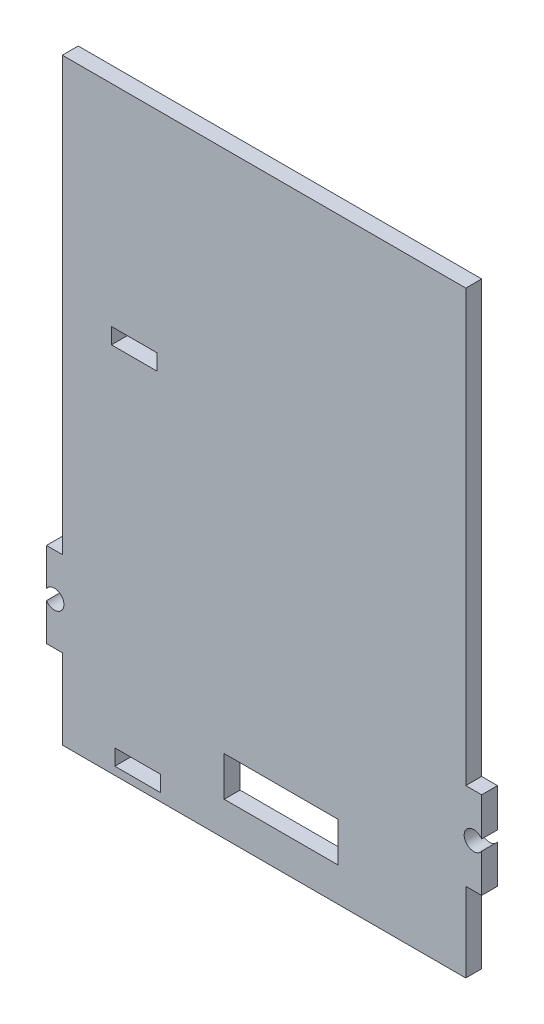
ISO-10303-21;
HEADER;
FILE_DESCRIPTION(('STEP AP214'),'2;1');
FILE_NAME('part.step','',(''),(''),'','','');
FILE_SCHEMA(('AUTOMOTIVE_DESIGN { 1 0 10303 214 1 1 1 1 }'));
ENDSEC;
DATA;
#1=APPLICATION_CONTEXT('core data for automotive mechanical design processes');
#2=APPLICATION_PROTOCOL_DEFINITION('international standard','automotive_design',2000,#1);
#3=PRODUCT_CONTEXT('',#1,'mechanical');
#4=PRODUCT('Part','Part','',(#3));
#5=PRODUCT_RELATED_PRODUCT_CATEGORY('part','',(#4));
#6=PRODUCT_DEFINITION_FORMATION('','',#4);
#7=PRODUCT_DEFINITION_CONTEXT('part definition',#1,'design');
#8=PRODUCT_DEFINITION('design','',#6,#7);
#9=PRODUCT_DEFINITION_SHAPE('','',#8);
#10=(LENGTH_UNIT() NAMED_UNIT(*) SI_UNIT(.MILLI.,.METRE.));
#11=(NAMED_UNIT(*) PLANE_ANGLE_UNIT() SI_UNIT($,.RADIAN.));
#12=(NAMED_UNIT(*) SI_UNIT($,.STERADIAN.) SOLID_ANGLE_UNIT());
#13=UNCERTAINTY_MEASURE_WITH_UNIT(LENGTH_MEASURE(1.E-05),#10,'distance_accuracy_value','');
#14=(GEOMETRIC_REPRESENTATION_CONTEXT(3) GLOBAL_UNCERTAINTY_ASSIGNED_CONTEXT((#13)) GLOBAL_UNIT_ASSIGNED_CONTEXT((#10,
#11,#12)) REPRESENTATION_CONTEXT('',''));
#15=CARTESIAN_POINT('',(0.,0.,0.));
#16=DIRECTION('',(0.,0.,1.));
#17=DIRECTION('',(1.,0.,0.));
#18=AXIS2_PLACEMENT_3D('',#15,#16,#17);
#19=CARTESIAN_POINT('',(0.,0.,3.175));
#20=DIRECTION('',(1.,0.,0.));
#21=DIRECTION('',(0.,1.,0.));
#22=AXIS2_PLACEMENT_3D('',#19,#20,#21);
#23=PLANE('',#22);
#24=DIRECTION('',(0.,-1.,0.));
#25=VECTOR('',#24,1.);
#26=CARTESIAN_POINT('',(0.,0.,3.175));
#27=LINE('',#26,#25);
#28=CARTESIAN_POINT('',(0.,-21.0210254457884,3.175));
#29=VERTEX_POINT('',#28);
#30=CARTESIAN_POINT('',(0.,-28.4669829879647,3.175));
#31=VERTEX_POINT('',#30);
#32=EDGE_CURVE('E393',#29,#31,#27,.T.);
#33=ORIENTED_EDGE('',*,*,#32,.F.);
#34=DIRECTION('',(0.,0.,-1.));
#35=VECTOR('',#34,1.);
#36=CARTESIAN_POINT('',(0.,-21.0210254457884,3.175));
#37=LINE('',#36,#35);
#38=CARTESIAN_POINT('',(0.,-21.0210254457884,0.));
#39=VERTEX_POINT('',#38);
#40=EDGE_CURVE('E417',#29,#39,#37,.T.);
#41=ORIENTED_EDGE('',*,*,#40,.T.);
#42=DIRECTION('',(0.,-1.,0.));
#43=VECTOR('',#42,1.);
#44=CARTESIAN_POINT('',(0.,0.,0.));
#45=LINE('',#44,#43);
#46=CARTESIAN_POINT('',(0.,-28.4669829879647,0.));
#47=VERTEX_POINT('',#46);
#48=EDGE_CURVE('E388',#39,#47,#45,.T.);
#49=ORIENTED_EDGE('',*,*,#48,.T.);
#50=DIRECTION('',(0.,0.,-1.));
#51=VECTOR('',#50,1.);
#52=CARTESIAN_POINT('',(0.,-28.4669829879647,3.175));
#53=LINE('',#52,#51);
#54=EDGE_CURVE('E291',#31,#47,#53,.T.);
#55=ORIENTED_EDGE('',*,*,#54,.F.);
#56=EDGE_LOOP('',(#33,#41,#49,#55));
#57=FACE_BOUND('',#56,.T.);
#58=ADVANCED_FACE('F33',(#57),#23,.F.);
#59=CARTESIAN_POINT('',(87.,0.,3.175));
#60=DIRECTION('',(-1.,0.,0.));
#61=DIRECTION('',(0.,0.,1.));
#62=AXIS2_PLACEMENT_3D('',#59,#60,#61);
#63=PLANE('',#62);
#64=DIRECTION('',(0.,1.,0.));
#65=VECTOR('',#64,1.);
#66=CARTESIAN_POINT('',(87.,0.,3.175));
#67=LINE('',#66,#65);
#68=CARTESIAN_POINT('',(87.,-18.8019716290622,3.175));
#69=VERTEX_POINT('',#68);
#70=CARTESIAN_POINT('',(87.,-11.14,3.175));
#71=VERTEX_POINT('',#70);
#72=EDGE_CURVE('E395',#69,#71,#67,.T.);
#73=ORIENTED_EDGE('',*,*,#72,.F.);
#74=DIRECTION('',(0.,0.,-1.));
#75=VECTOR('',#74,1.);
#76=CARTESIAN_POINT('',(87.,-18.8019716290622,3.175));
#77=LINE('',#76,#75);
#78=CARTESIAN_POINT('',(87.,-18.8019716290622,0.));
#79=VERTEX_POINT('',#78);
#80=EDGE_CURVE('E411',#69,#79,#77,.T.);
#81=ORIENTED_EDGE('',*,*,#80,.T.);
#82=DIRECTION('',(0.,1.,0.));
#83=VECTOR('',#82,1.);
#84=CARTESIAN_POINT('',(87.,0.,0.));
#85=LINE('',#84,#83);
#86=CARTESIAN_POINT('',(87.,-11.14,0.));
#87=VERTEX_POINT('',#86);
#88=EDGE_CURVE('E405',#79,#87,#85,.T.);
#89=ORIENTED_EDGE('',*,*,#88,.T.);
#90=DIRECTION('',(0.,0.,-1.));
#91=VECTOR('',#90,1.);
#92=CARTESIAN_POINT('',(87.,-11.14,3.175));
#93=LINE('',#92,#91);
#94=EDGE_CURVE('E349',#71,#87,#93,.T.);
#95=ORIENTED_EDGE('',*,*,#94,.F.);
#96=EDGE_LOOP('',(#73,#81,#89,#95));
#97=FACE_BOUND('',#96,.T.);
#98=ADVANCED_FACE('F456',(#97),#63,.F.);
#99=CARTESIAN_POINT('',(0.,0.,3.175));
#100=DIRECTION('',(0.,0.,1.));
#101=DIRECTION('',(1.,0.,0.));
#102=AXIS2_PLACEMENT_3D('',#99,#100,#101);
#103=PLANE('',#102);
#104=DIRECTION('',(0.,-1.,0.));
#105=VECTOR('',#104,1.);
#106=CARTESIAN_POINT('',(35.5298309441785,-37.650051224249,3.175));
#107=LINE('',#106,#105);
#108=CARTESIAN_POINT('',(35.5298309441785,-29.741586599723,3.175));
#109=VERTEX_POINT('',#108);
#110=CARTESIAN_POINT('',(35.5298309441785,-37.650051224249,3.175));
#111=VERTEX_POINT('',#110);
#112=EDGE_CURVE('E48',#109,#111,#107,.T.);
#113=ORIENTED_EDGE('',*,*,#112,.F.);
#114=DIRECTION('',(-1.,0.,0.));
#115=VECTOR('',#114,1.);
#116=CARTESIAN_POINT('',(35.5298309441785,-29.741586599723,3.175));
#117=LINE('',#116,#115);
#118=CARTESIAN_POINT('',(58.3167058499912,-29.741586599723,3.175));
#119=VERTEX_POINT('',#118);
#120=EDGE_CURVE('E237',#119,#109,#117,.T.);
#121=ORIENTED_EDGE('',*,*,#120,.F.);
#122=DIRECTION('',(0.,1.,0.));
#123=VECTOR('',#122,1.);
#124=CARTESIAN_POINT('',(58.3167058499912,-37.650051224249,3.175));
#125=LINE('',#124,#123);
#126=CARTESIAN_POINT('',(58.3167058499912,-37.650051224249,3.175));
#127=VERTEX_POINT('',#126);
#128=EDGE_CURVE('E221',#127,#119,#125,.T.);
#129=ORIENTED_EDGE('',*,*,#128,.F.);
#130=DIRECTION('',(1.,0.,0.));
#131=VECTOR('',#130,1.);
#132=CARTESIAN_POINT('',(35.5298309441785,-37.650051224249,3.175));
#133=LINE('',#132,#131);
#134=EDGE_CURVE('E230',#111,#127,#133,.T.);
#135=ORIENTED_EDGE('',*,*,#134,.F.);
#136=EDGE_LOOP('',(#113,#121,#129,#135));
#137=FACE_BOUND('',#136,.T.);
#138=DIRECTION('',(0.,-1.,0.));
#139=VECTOR('',#138,1.);
#140=CARTESIAN_POINT('',(12.9917093664923,29.7565826008522,3.175));
#141=LINE('',#140,#139);
#142=CARTESIAN_POINT('',(12.9917093664923,32.9365826008522,3.175));
#143=VERTEX_POINT('',#142);
#144=CARTESIAN_POINT('',(12.9917093664923,29.7565826008522,3.175));
#145=VERTEX_POINT('',#144);
#146=EDGE_CURVE('E244',#143,#145,#141,.T.);
#147=ORIENTED_EDGE('',*,*,#146,.F.);
#148=DIRECTION('',(-1.,0.,0.));
#149=VECTOR('',#148,1.);
#150=CARTESIAN_POINT('',(12.9917093664923,32.9365826008522,3.175));
#151=LINE('',#150,#149);
#152=CARTESIAN_POINT('',(22.1317093664923,32.9365826008522,3.175));
#153=VERTEX_POINT('',#152);
#154=EDGE_CURVE('E254',#153,#143,#151,.T.);
#155=ORIENTED_EDGE('',*,*,#154,.F.);
#156=DIRECTION('',(0.,1.,0.));
#157=VECTOR('',#156,1.);
#158=CARTESIAN_POINT('',(22.1317093664923,29.7565826008522,3.175));
#159=LINE('',#158,#157);
#160=CARTESIAN_POINT('',(22.1317093664923,29.7565826008522,3.175));
#161=VERTEX_POINT('',#160);
#162=EDGE_CURVE('E251',#161,#153,#159,.T.);
#163=ORIENTED_EDGE('',*,*,#162,.F.);
#164=DIRECTION('',(1.,0.,0.));
#165=VECTOR('',#164,1.);
#166=CARTESIAN_POINT('',(12.9917093664923,29.7565826008522,3.175));
#167=LINE('',#166,#165);
#168=EDGE_CURVE('E248',#145,#161,#167,.T.);
#169=ORIENTED_EDGE('',*,*,#168,.F.);
#170=EDGE_LOOP('',(#147,#155,#163,#169));
#171=FACE_BOUND('',#170,.T.);
#172=CARTESIAN_POINT('',(1.5875,-19.9679970748505,3.175));
#173=DIRECTION('',(0.,0.,-1.));
#174=DIRECTION('',(-1.,0.,0.));
#175=AXIS2_PLACEMENT_3D('',#172,#173,#174);
#176=CIRCLE('',#175,1.905);
#177=CARTESIAN_POINT('',(0.,-18.9149687039127,3.175));
#178=VERTEX_POINT('',#177);
#179=EDGE_CURVE('E279',#178,#29,#176,.T.);
#180=ORIENTED_EDGE('',*,*,#179,.T.);
#181=ORIENTED_EDGE('',*,*,#32,.T.);
#182=DIRECTION('',(1.,0.,0.));
#183=VECTOR('',#182,1.);
#184=CARTESIAN_POINT('',(0.,-28.4669829879647,3.175));
#185=LINE('',#184,#183);
#186=CARTESIAN_POINT('',(3.175,-28.4669829879647,3.175));
#187=VERTEX_POINT('',#186);
#188=EDGE_CURVE('E284',#31,#187,#185,.T.);
#189=ORIENTED_EDGE('',*,*,#188,.T.);
#190=DIRECTION('',(0.,-1.,0.));
#191=VECTOR('',#190,1.);
#192=CARTESIAN_POINT('',(3.175,-44.45,3.175));
#193=LINE('',#192,#191);
#194=CARTESIAN_POINT('',(3.175,-44.45,3.175));
#195=VERTEX_POINT('',#194);
#196=EDGE_CURVE('E287',#187,#195,#193,.T.);
#197=ORIENTED_EDGE('',*,*,#196,.T.);
#198=DIRECTION('',(1.,0.,0.));
#199=VECTOR('',#198,1.);
#200=CARTESIAN_POINT('',(0.,-44.45,3.175));
#201=LINE('',#200,#199);
#202=CARTESIAN_POINT('',(83.825,-44.45,3.175));
#203=VERTEX_POINT('',#202);
#204=EDGE_CURVE('E392',#195,#203,#201,.T.);
#205=ORIENTED_EDGE('',*,*,#204,.T.);
#206=DIRECTION('',(0.,1.,0.));
#207=VECTOR('',#206,1.);
#208=CARTESIAN_POINT('',(83.825,-44.45,3.175));
#209=LINE('',#208,#207);
#210=CARTESIAN_POINT('',(83.825,-28.57,3.175));
#211=VERTEX_POINT('',#210);
#212=EDGE_CURVE('E324',#203,#211,#209,.T.);
#213=ORIENTED_EDGE('',*,*,#212,.T.);
#214=DIRECTION('',(1.,0.,0.));
#215=VECTOR('',#214,1.);
#216=CARTESIAN_POINT('',(87.,-28.57,3.175));
#217=LINE('',#216,#215);
#218=CARTESIAN_POINT('',(87.,-28.57,3.175));
#219=VERTEX_POINT('',#218);
#220=EDGE_CURVE('E327',#211,#219,#217,.T.);
#221=ORIENTED_EDGE('',*,*,#220,.T.);
#222=CARTESIAN_POINT('',(87.,-20.9080283709378,3.175));
#223=VERTEX_POINT('',#222);
#224=EDGE_CURVE('E396',#219,#223,#67,.T.);
#225=ORIENTED_EDGE('',*,*,#224,.T.);
#226=CARTESIAN_POINT('',(85.4125,-19.855,3.175));
#227=DIRECTION('',(0.,0.,-1.));
#228=DIRECTION('',(-1.,0.,0.));
#229=AXIS2_PLACEMENT_3D('',#226,#227,#228);
#230=CIRCLE('',#229,1.90500000000001);
#231=EDGE_CURVE('E319',#223,#69,#230,.T.);
#232=ORIENTED_EDGE('',*,*,#231,.T.);
#233=ORIENTED_EDGE('',*,*,#72,.T.);
#234=DIRECTION('',(-1.,0.,0.));
#235=VECTOR('',#234,1.);
#236=CARTESIAN_POINT('',(87.,-11.14,3.175));
#237=LINE('',#236,#235);
#238=CARTESIAN_POINT('',(83.825,-11.14,3.175));
#239=VERTEX_POINT('',#238);
#240=EDGE_CURVE('E343',#71,#239,#237,.T.);
#241=ORIENTED_EDGE('',*,*,#240,.T.);
#242=DIRECTION('',(0.,1.,0.));
#243=VECTOR('',#242,1.);
#244=CARTESIAN_POINT('',(83.825,0.,3.175));
#245=LINE('',#244,#243);
#246=CARTESIAN_POINT('',(83.825,75.,3.175));
#247=VERTEX_POINT('',#246);
#248=EDGE_CURVE('E346',#239,#247,#245,.T.);
#249=ORIENTED_EDGE('',*,*,#248,.T.);
#250=DIRECTION('',(1.,0.,0.));
#251=VECTOR('',#250,1.);
#252=CARTESIAN_POINT('',(83.825,75.,3.175));
#253=LINE('',#252,#251);
#254=CARTESIAN_POINT('',(3.175,75.,3.175));
#255=VERTEX_POINT('',#254);
#256=EDGE_CURVE('E275',#255,#247,#253,.T.);
#257=ORIENTED_EDGE('',*,*,#256,.F.);
#258=DIRECTION('',(0.,-1.,0.));
#259=VECTOR('',#258,1.);
#260=CARTESIAN_POINT('',(3.175,0.,3.175));
#261=LINE('',#260,#259);
#262=CARTESIAN_POINT('',(3.175,-11.4690111617364,3.175));
#263=VERTEX_POINT('',#262);
#264=EDGE_CURVE('E303',#255,#263,#261,.T.);
#265=ORIENTED_EDGE('',*,*,#264,.T.);
#266=DIRECTION('',(-1.,0.,0.));
#267=VECTOR('',#266,1.);
#268=CARTESIAN_POINT('',(0.,-11.4690111617364,3.175));
#269=LINE('',#268,#267);
#270=CARTESIAN_POINT('',(0.,-11.4690111617364,3.175));
#271=VERTEX_POINT('',#270);
#272=EDGE_CURVE('E306',#263,#271,#269,.T.);
#273=ORIENTED_EDGE('',*,*,#272,.T.);
#274=EDGE_CURVE('E389',#271,#178,#27,.T.);
#275=ORIENTED_EDGE('',*,*,#274,.T.);
#276=EDGE_LOOP('',(#180,#181,#189,#197,#205,#213,#221,#225,#232,#233,#241,#249,#257,#265,#273,#275));
#277=FACE_BOUND('',#276,.T.);
#278=DIRECTION('',(-1.,0.,0.));
#279=VECTOR('',#278,1.);
#280=CARTESIAN_POINT('',(22.8034127757652,-39.685,3.175));
#281=LINE('',#280,#279);
#282=CARTESIAN_POINT('',(22.8034127757652,-39.685,3.175));
#283=VERTEX_POINT('',#282);
#284=CARTESIAN_POINT('',(13.6607336706138,-39.685,3.175));
#285=VERTEX_POINT('',#284);
#286=EDGE_CURVE('E360',#283,#285,#281,.T.);
#287=ORIENTED_EDGE('',*,*,#286,.F.);
#288=DIRECTION('',(0.,1.,0.));
#289=VECTOR('',#288,1.);
#290=CARTESIAN_POINT('',(22.8034127757652,-39.685,3.175));
#291=LINE('',#290,#289);
#292=CARTESIAN_POINT('',(22.8034127757653,-42.86,3.175));
#293=VERTEX_POINT('',#292);
#294=EDGE_CURVE('E358',#293,#283,#291,.T.);
#295=ORIENTED_EDGE('',*,*,#294,.F.);
#296=DIRECTION('',(1.,0.,0.));
#297=VECTOR('',#296,1.);
#298=CARTESIAN_POINT('',(22.8034127757653,-42.86,3.175));
#299=LINE('',#298,#297);
#300=CARTESIAN_POINT('',(13.6607336706138,-42.86,3.175));
#301=VERTEX_POINT('',#300);
#302=EDGE_CURVE('E366',#301,#293,#299,.T.);
#303=ORIENTED_EDGE('',*,*,#302,.F.);
#304=DIRECTION('',(0.,-1.,0.));
#305=VECTOR('',#304,1.);
#306=CARTESIAN_POINT('',(13.6607336706138,-39.685,3.175));
#307=LINE('',#306,#305);
#308=EDGE_CURVE('E363',#285,#301,#307,.T.);
#309=ORIENTED_EDGE('',*,*,#308,.F.);
#310=EDGE_LOOP('',(#287,#295,#303,#309));
#311=FACE_BOUND('',#310,.T.);
#312=ADVANCED_FACE('F234',(#137,#171,#277,#311),#103,.T.);
#313=CARTESIAN_POINT('',(0.,0.,0.));
#314=DIRECTION('',(0.,0.,1.));
#315=DIRECTION('',(1.,0.,0.));
#316=AXIS2_PLACEMENT_3D('',#313,#314,#315);
#317=PLANE('',#316);
#318=DIRECTION('',(-1.,0.,0.));
#319=VECTOR('',#318,1.);
#320=CARTESIAN_POINT('',(0.,-29.741586599723,0.));
#321=LINE('',#320,#319);
#322=CARTESIAN_POINT('',(58.3167058499912,-29.741586599723,0.));
#323=VERTEX_POINT('',#322);
#324=CARTESIAN_POINT('',(35.5298309441785,-29.741586599723,0.));
#325=VERTEX_POINT('',#324);
#326=EDGE_CURVE('E41',#323,#325,#321,.T.);
#327=ORIENTED_EDGE('',*,*,#326,.T.);
#328=DIRECTION('',(0.,-1.,0.));
#329=VECTOR('',#328,1.);
#330=CARTESIAN_POINT('',(35.5298309441785,0.,0.));
#331=LINE('',#330,#329);
#332=CARTESIAN_POINT('',(35.5298309441785,-37.650051224249,0.));
#333=VERTEX_POINT('',#332);
#334=EDGE_CURVE('E11',#325,#333,#331,.T.);
#335=ORIENTED_EDGE('',*,*,#334,.T.);
#336=DIRECTION('',(1.,0.,0.));
#337=VECTOR('',#336,1.);
#338=CARTESIAN_POINT('',(0.,-37.650051224249,0.));
#339=LINE('',#338,#337);
#340=CARTESIAN_POINT('',(58.3167058499912,-37.650051224249,0.));
#341=VERTEX_POINT('',#340);
#342=EDGE_CURVE('E432',#333,#341,#339,.T.);
#343=ORIENTED_EDGE('',*,*,#342,.T.);
#344=DIRECTION('',(0.,1.,0.));
#345=VECTOR('',#344,1.);
#346=CARTESIAN_POINT('',(58.3167058499912,0.,0.));
#347=LINE('',#346,#345);
#348=EDGE_CURVE('E224',#341,#323,#347,.T.);
#349=ORIENTED_EDGE('',*,*,#348,.T.);
#350=EDGE_LOOP('',(#327,#335,#343,#349));
#351=FACE_BOUND('',#350,.T.);
#352=DIRECTION('',(-1.,0.,0.));
#353=VECTOR('',#352,1.);
#354=CARTESIAN_POINT('',(0.,32.9365826008522,0.));
#355=LINE('',#354,#353);
#356=CARTESIAN_POINT('',(22.1317093664923,32.9365826008522,0.));
#357=VERTEX_POINT('',#356);
#358=CARTESIAN_POINT('',(12.9917093664923,32.9365826008522,0.));
#359=VERTEX_POINT('',#358);
#360=EDGE_CURVE('E426',#357,#359,#355,.T.);
#361=ORIENTED_EDGE('',*,*,#360,.T.);
#362=DIRECTION('',(0.,-1.,0.));
#363=VECTOR('',#362,1.);
#364=CARTESIAN_POINT('',(12.9917093664923,0.,0.));
#365=LINE('',#364,#363);
#366=CARTESIAN_POINT('',(12.9917093664923,29.7565826008522,0.));
#367=VERTEX_POINT('',#366);
#368=EDGE_CURVE('E429',#359,#367,#365,.T.);
#369=ORIENTED_EDGE('',*,*,#368,.T.);
#370=DIRECTION('',(1.,0.,0.));
#371=VECTOR('',#370,1.);
#372=CARTESIAN_POINT('',(0.,29.7565826008522,0.));
#373=LINE('',#372,#371);
#374=CARTESIAN_POINT('',(22.1317093664923,29.7565826008522,0.));
#375=VERTEX_POINT('',#374);
#376=EDGE_CURVE('E420',#367,#375,#373,.T.);
#377=ORIENTED_EDGE('',*,*,#376,.T.);
#378=DIRECTION('',(0.,1.,0.));
#379=VECTOR('',#378,1.);
#380=CARTESIAN_POINT('',(22.1317093664923,0.,0.));
#381=LINE('',#380,#379);
#382=EDGE_CURVE('E423',#375,#357,#381,.T.);
#383=ORIENTED_EDGE('',*,*,#382,.T.);
#384=EDGE_LOOP('',(#361,#369,#377,#383));
#385=FACE_BOUND('',#384,.T.);
#386=ORIENTED_EDGE('',*,*,#48,.F.);
#387=CARTESIAN_POINT('',(1.5875,-19.9679970748505,0.));
#388=DIRECTION('',(0.,0.,-1.));
#389=DIRECTION('',(-1.,0.,0.));
#390=AXIS2_PLACEMENT_3D('',#387,#388,#389);
#391=CIRCLE('',#390,1.905);
#392=CARTESIAN_POINT('',(0.,-18.9149687039127,0.));
#393=VERTEX_POINT('',#392);
#394=EDGE_CURVE('E278',#393,#39,#391,.T.);
#395=ORIENTED_EDGE('',*,*,#394,.F.);
#396=CARTESIAN_POINT('',(0.,-11.4690111617364,0.));
#397=VERTEX_POINT('',#396);
#398=EDGE_CURVE('E400',#397,#393,#45,.T.);
#399=ORIENTED_EDGE('',*,*,#398,.F.);
#400=DIRECTION('',(-1.,0.,0.));
#401=VECTOR('',#400,1.);
#402=CARTESIAN_POINT('',(0.,-11.4690111617364,0.));
#403=LINE('',#402,#401);
#404=CARTESIAN_POINT('',(3.175,-11.4690111617364,0.));
#405=VERTEX_POINT('',#404);
#406=EDGE_CURVE('E307',#405,#397,#403,.T.);
#407=ORIENTED_EDGE('',*,*,#406,.F.);
#408=DIRECTION('',(0.,-1.,0.));
#409=VECTOR('',#408,1.);
#410=CARTESIAN_POINT('',(3.175,0.,0.));
#411=LINE('',#410,#409);
#412=CARTESIAN_POINT('',(3.175,75.,0.));
#413=VERTEX_POINT('',#412);
#414=EDGE_CURVE('E298',#413,#405,#411,.T.);
#415=ORIENTED_EDGE('',*,*,#414,.F.);
#416=DIRECTION('',(-1.,0.,0.));
#417=VECTOR('',#416,1.);
#418=CARTESIAN_POINT('',(83.825,75.,0.));
#419=LINE('',#418,#417);
#420=CARTESIAN_POINT('',(83.825,75.,0.));
#421=VERTEX_POINT('',#420);
#422=EDGE_CURVE('E269',#421,#413,#419,.T.);
#423=ORIENTED_EDGE('',*,*,#422,.F.);
#424=DIRECTION('',(0.,1.,0.));
#425=VECTOR('',#424,1.);
#426=CARTESIAN_POINT('',(83.825,0.,0.));
#427=LINE('',#426,#425);
#428=CARTESIAN_POINT('',(83.825,-11.14,0.));
#429=VERTEX_POINT('',#428);
#430=EDGE_CURVE('E347',#429,#421,#427,.T.);
#431=ORIENTED_EDGE('',*,*,#430,.F.);
#432=DIRECTION('',(-1.,0.,0.));
#433=VECTOR('',#432,1.);
#434=CARTESIAN_POINT('',(87.,-11.14,0.));
#435=LINE('',#434,#433);
#436=EDGE_CURVE('E338',#87,#429,#435,.T.);
#437=ORIENTED_EDGE('',*,*,#436,.F.);
#438=ORIENTED_EDGE('',*,*,#88,.F.);
#439=CARTESIAN_POINT('',(85.4125,-19.855,0.));
#440=DIRECTION('',(0.,0.,-1.));
#441=DIRECTION('',(-1.,0.,0.));
#442=AXIS2_PLACEMENT_3D('',#439,#440,#441);
#443=CIRCLE('',#442,1.90500000000001);
#444=CARTESIAN_POINT('',(87.,-20.9080283709378,0.));
#445=VERTEX_POINT('',#444);
#446=EDGE_CURVE('E317',#445,#79,#443,.T.);
#447=ORIENTED_EDGE('',*,*,#446,.F.);
#448=CARTESIAN_POINT('',(87.,-28.57,0.));
#449=VERTEX_POINT('',#448);
#450=EDGE_CURVE('E406',#449,#445,#85,.T.);
#451=ORIENTED_EDGE('',*,*,#450,.F.);
#452=DIRECTION('',(1.,0.,0.));
#453=VECTOR('',#452,1.);
#454=CARTESIAN_POINT('',(87.,-28.57,0.));
#455=LINE('',#454,#453);
#456=CARTESIAN_POINT('',(83.825,-28.57,0.));
#457=VERTEX_POINT('',#456);
#458=EDGE_CURVE('E328',#457,#449,#455,.T.);
#459=ORIENTED_EDGE('',*,*,#458,.F.);
#460=DIRECTION('',(0.,1.,0.));
#461=VECTOR('',#460,1.);
#462=CARTESIAN_POINT('',(83.825,-44.45,0.));
#463=LINE('',#462,#461);
#464=CARTESIAN_POINT('',(83.825,-44.45,0.));
#465=VERTEX_POINT('',#464);
#466=EDGE_CURVE('E322',#465,#457,#463,.T.);
#467=ORIENTED_EDGE('',*,*,#466,.F.);
#468=DIRECTION('',(1.,0.,0.));
#469=VECTOR('',#468,1.);
#470=CARTESIAN_POINT('',(0.,-44.45,0.));
#471=LINE('',#470,#469);
#472=CARTESIAN_POINT('',(3.175,-44.45,0.));
#473=VERTEX_POINT('',#472);
#474=EDGE_CURVE('E403',#473,#465,#471,.T.);
#475=ORIENTED_EDGE('',*,*,#474,.F.);
#476=DIRECTION('',(0.,-1.,0.));
#477=VECTOR('',#476,1.);
#478=CARTESIAN_POINT('',(3.175,-44.45,0.));
#479=LINE('',#478,#477);
#480=CARTESIAN_POINT('',(3.175,-28.4669829879647,0.));
#481=VERTEX_POINT('',#480);
#482=EDGE_CURVE('E288',#481,#473,#479,.T.);
#483=ORIENTED_EDGE('',*,*,#482,.F.);
#484=DIRECTION('',(1.,0.,0.));
#485=VECTOR('',#484,1.);
#486=CARTESIAN_POINT('',(0.,-28.4669829879647,0.));
#487=LINE('',#486,#485);
#488=EDGE_CURVE('E282',#47,#481,#487,.T.);
#489=ORIENTED_EDGE('',*,*,#488,.F.);
#490=EDGE_LOOP('',(#386,#395,#399,#407,#415,#423,#431,#437,#438,#447,#451,#459,#467,#475,#483,#489));
#491=FACE_BOUND('',#490,.T.);
#492=DIRECTION('',(0.,1.,0.));
#493=VECTOR('',#492,1.);
#494=CARTESIAN_POINT('',(22.8034127757652,-39.685,0.));
#495=LINE('',#494,#493);
#496=CARTESIAN_POINT('',(22.8034127757653,-42.86,0.));
#497=VERTEX_POINT('',#496);
#498=CARTESIAN_POINT('',(22.8034127757652,-39.685,0.));
#499=VERTEX_POINT('',#498);
#500=EDGE_CURVE('E355',#497,#499,#495,.T.);
#501=ORIENTED_EDGE('',*,*,#500,.T.);
#502=DIRECTION('',(-1.,0.,0.));
#503=VECTOR('',#502,1.);
#504=CARTESIAN_POINT('',(22.8034127757652,-39.685,0.));
#505=LINE('',#504,#503);
#506=CARTESIAN_POINT('',(13.6607336706138,-39.685,0.));
#507=VERTEX_POINT('',#506);
#508=EDGE_CURVE('E371',#499,#507,#505,.T.);
#509=ORIENTED_EDGE('',*,*,#508,.T.);
#510=DIRECTION('',(0.,-1.,0.));
#511=VECTOR('',#510,1.);
#512=CARTESIAN_POINT('',(13.6607336706138,-39.685,0.));
#513=LINE('',#512,#511);
#514=CARTESIAN_POINT('',(13.6607336706138,-42.86,0.));
#515=VERTEX_POINT('',#514);
#516=EDGE_CURVE('E374',#507,#515,#513,.T.);
#517=ORIENTED_EDGE('',*,*,#516,.T.);
#518=DIRECTION('',(1.,0.,0.));
#519=VECTOR('',#518,1.);
#520=CARTESIAN_POINT('',(22.8034127757653,-42.86,0.));
#521=LINE('',#520,#519);
#522=EDGE_CURVE('E361',#515,#497,#521,.T.);
#523=ORIENTED_EDGE('',*,*,#522,.T.);
#524=EDGE_LOOP('',(#501,#509,#517,#523));
#525=FACE_BOUND('',#524,.T.);
#526=ADVANCED_FACE('F436',(#351,#385,#491,#525),#317,.F.);
#527=ORIENTED_EDGE('',*,*,#398,.T.);
#528=DIRECTION('',(0.,0.,-1.));
#529=VECTOR('',#528,1.);
#530=CARTESIAN_POINT('',(0.,-18.9149687039127,3.175));
#531=LINE('',#530,#529);
#532=EDGE_CURVE('E414',#393,#178,#531,.F.);
#533=ORIENTED_EDGE('',*,*,#532,.T.);
#534=ORIENTED_EDGE('',*,*,#274,.F.);
#535=DIRECTION('',(0.,0.,-1.));
#536=VECTOR('',#535,1.);
#537=CARTESIAN_POINT('',(0.,-11.4690111617364,3.175));
#538=LINE('',#537,#536);
#539=EDGE_CURVE('E314',#271,#397,#538,.T.);
#540=ORIENTED_EDGE('',*,*,#539,.T.);
#541=EDGE_LOOP('',(#527,#533,#534,#540));
#542=FACE_BOUND('',#541,.T.);
#543=ADVANCED_FACE('F35',(#542),#23,.F.);
#544=CARTESIAN_POINT('',(0.,-44.45,3.175));
#545=DIRECTION('',(0.,1.,0.));
#546=DIRECTION('',(0.,0.,1.));
#547=AXIS2_PLACEMENT_3D('',#544,#545,#546);
#548=PLANE('',#547);
#549=ORIENTED_EDGE('',*,*,#204,.F.);
#550=DIRECTION('',(0.,0.,-1.));
#551=VECTOR('',#550,1.);
#552=CARTESIAN_POINT('',(3.175,-44.45,3.175));
#553=LINE('',#552,#551);
#554=EDGE_CURVE('E295',#195,#473,#553,.T.);
#555=ORIENTED_EDGE('',*,*,#554,.T.);
#556=ORIENTED_EDGE('',*,*,#474,.T.);
#557=DIRECTION('',(0.,0.,-1.));
#558=VECTOR('',#557,1.);
#559=CARTESIAN_POINT('',(83.825,-44.45,3.175));
#560=LINE('',#559,#558);
#561=EDGE_CURVE('E331',#203,#465,#560,.T.);
#562=ORIENTED_EDGE('',*,*,#561,.F.);
#563=EDGE_LOOP('',(#549,#555,#556,#562));
#564=FACE_BOUND('',#563,.T.);
#565=ADVANCED_FACE('F466',(#564),#548,.F.);
#566=ORIENTED_EDGE('',*,*,#450,.T.);
#567=DIRECTION('',(0.,0.,-1.));
#568=VECTOR('',#567,1.);
#569=CARTESIAN_POINT('',(87.,-20.9080283709378,3.175));
#570=LINE('',#569,#568);
#571=EDGE_CURVE('E399',#445,#223,#570,.F.);
#572=ORIENTED_EDGE('',*,*,#571,.T.);
#573=ORIENTED_EDGE('',*,*,#224,.F.);
#574=DIRECTION('',(0.,0.,-1.));
#575=VECTOR('',#574,1.);
#576=CARTESIAN_POINT('',(87.,-28.57,3.175));
#577=LINE('',#576,#575);
#578=EDGE_CURVE('E335',#219,#449,#577,.T.);
#579=ORIENTED_EDGE('',*,*,#578,.T.);
#580=EDGE_LOOP('',(#566,#572,#573,#579));
#581=FACE_BOUND('',#580,.T.);
#582=ADVANCED_FACE('F463',(#581),#63,.F.);
#583=CARTESIAN_POINT('',(22.8034127757652,-39.685,3.175));
#584=DIRECTION('',(-1.,0.,0.));
#585=DIRECTION('',(0.,-1.,0.));
#586=AXIS2_PLACEMENT_3D('',#583,#584,#585);
#587=PLANE('',#586);
#588=ORIENTED_EDGE('',*,*,#500,.F.);
#589=DIRECTION('',(0.,0.,-1.));
#590=VECTOR('',#589,1.);
#591=CARTESIAN_POINT('',(22.8034127757653,-42.86,3.175));
#592=LINE('',#591,#590);
#593=EDGE_CURVE('E368',#293,#497,#592,.T.);
#594=ORIENTED_EDGE('',*,*,#593,.F.);
#595=ORIENTED_EDGE('',*,*,#294,.T.);
#596=DIRECTION('',(0.,0.,-1.));
#597=VECTOR('',#596,1.);
#598=CARTESIAN_POINT('',(22.8034127757652,-39.685,3.175));
#599=LINE('',#598,#597);
#600=EDGE_CURVE('E385',#283,#499,#599,.T.);
#601=ORIENTED_EDGE('',*,*,#600,.T.);
#602=EDGE_LOOP('',(#588,#594,#595,#601));
#603=FACE_BOUND('',#602,.T.);
#604=ADVANCED_FACE('F563',(#603),#587,.T.);
#605=CARTESIAN_POINT('',(22.8034127757652,-39.685,3.175));
#606=DIRECTION('',(0.,-1.,0.));
#607=DIRECTION('',(0.,0.,-1.));
#608=AXIS2_PLACEMENT_3D('',#605,#606,#607);
#609=PLANE('',#608);
#610=ORIENTED_EDGE('',*,*,#508,.F.);
#611=ORIENTED_EDGE('',*,*,#600,.F.);
#612=ORIENTED_EDGE('',*,*,#286,.T.);
#613=DIRECTION('',(0.,0.,-1.));
#614=VECTOR('',#613,1.);
#615=CARTESIAN_POINT('',(13.6607336706138,-39.685,3.175));
#616=LINE('',#615,#614);
#617=EDGE_CURVE('E383',#285,#507,#616,.T.);
#618=ORIENTED_EDGE('',*,*,#617,.T.);
#619=EDGE_LOOP('',(#610,#611,#612,#618));
#620=FACE_BOUND('',#619,.T.);
#621=ADVANCED_FACE('F559',(#620),#609,.T.);
#622=CARTESIAN_POINT('',(13.6607336706138,-39.685,3.175));
#623=DIRECTION('',(1.,0.,0.));
#624=DIRECTION('',(0.,0.,-1.));
#625=AXIS2_PLACEMENT_3D('',#622,#623,#624);
#626=PLANE('',#625);
#627=ORIENTED_EDGE('',*,*,#516,.F.);
#628=ORIENTED_EDGE('',*,*,#617,.F.);
#629=ORIENTED_EDGE('',*,*,#308,.T.);
#630=DIRECTION('',(0.,0.,-1.));
#631=VECTOR('',#630,1.);
#632=CARTESIAN_POINT('',(13.6607336706138,-42.86,3.175));
#633=LINE('',#632,#631);
#634=EDGE_CURVE('E381',#301,#515,#633,.T.);
#635=ORIENTED_EDGE('',*,*,#634,.T.);
#636=EDGE_LOOP('',(#627,#628,#629,#635));
#637=FACE_BOUND('',#636,.T.);
#638=ADVANCED_FACE('F555',(#637),#626,.T.);
#639=CARTESIAN_POINT('',(22.8034127757653,-42.86,3.175));
#640=DIRECTION('',(0.,1.,0.));
#641=DIRECTION('',(0.,0.,1.));
#642=AXIS2_PLACEMENT_3D('',#639,#640,#641);
#643=PLANE('',#642);
#644=ORIENTED_EDGE('',*,*,#522,.F.);
#645=ORIENTED_EDGE('',*,*,#634,.F.);
#646=ORIENTED_EDGE('',*,*,#302,.T.);
#647=ORIENTED_EDGE('',*,*,#593,.T.);
#648=EDGE_LOOP('',(#644,#645,#646,#647));
#649=FACE_BOUND('',#648,.T.);
#650=ADVANCED_FACE('F550',(#649),#643,.T.);
#651=CARTESIAN_POINT('',(83.825,0.,3.175));
#652=DIRECTION('',(-1.,0.,0.));
#653=DIRECTION('',(0.,0.,1.));
#654=AXIS2_PLACEMENT_3D('',#651,#652,#653);
#655=PLANE('',#654);
#656=ORIENTED_EDGE('',*,*,#430,.T.);
#657=DIRECTION('',(0.,0.,-1.));
#658=VECTOR('',#657,1.);
#659=CARTESIAN_POINT('',(83.825,75.,0.));
#660=LINE('',#659,#658);
#661=EDGE_CURVE('E260',#247,#421,#660,.T.);
#662=ORIENTED_EDGE('',*,*,#661,.F.);
#663=ORIENTED_EDGE('',*,*,#248,.F.);
#664=DIRECTION('',(0.,0.,-1.));
#665=VECTOR('',#664,1.);
#666=CARTESIAN_POINT('',(83.825,-11.14,3.175));
#667=LINE('',#666,#665);
#668=EDGE_CURVE('E353',#239,#429,#667,.T.);
#669=ORIENTED_EDGE('',*,*,#668,.T.);
#670=EDGE_LOOP('',(#656,#662,#663,#669));
#671=FACE_BOUND('',#670,.T.);
#672=ADVANCED_FACE('F521',(#671),#655,.F.);
#673=CARTESIAN_POINT('',(87.,-11.14,3.175));
#674=DIRECTION('',(0.,-1.,0.));
#675=DIRECTION('',(0.,0.,-1.));
#676=AXIS2_PLACEMENT_3D('',#673,#674,#675);
#677=PLANE('',#676);
#678=ORIENTED_EDGE('',*,*,#436,.T.);
#679=ORIENTED_EDGE('',*,*,#668,.F.);
#680=ORIENTED_EDGE('',*,*,#240,.F.);
#681=ORIENTED_EDGE('',*,*,#94,.T.);
#682=EDGE_LOOP('',(#678,#679,#680,#681));
#683=FACE_BOUND('',#682,.T.);
#684=ADVANCED_FACE('F516',(#683),#677,.F.);
#685=CARTESIAN_POINT('',(87.,-28.57,3.175));
#686=DIRECTION('',(0.,1.,0.));
#687=DIRECTION('',(0.,0.,1.));
#688=AXIS2_PLACEMENT_3D('',#685,#686,#687);
#689=PLANE('',#688);
#690=ORIENTED_EDGE('',*,*,#458,.T.);
#691=ORIENTED_EDGE('',*,*,#578,.F.);
#692=ORIENTED_EDGE('',*,*,#220,.F.);
#693=DIRECTION('',(0.,0.,-1.));
#694=VECTOR('',#693,1.);
#695=CARTESIAN_POINT('',(83.825,-28.57,3.175));
#696=LINE('',#695,#694);
#697=EDGE_CURVE('E339',#211,#457,#696,.T.);
#698=ORIENTED_EDGE('',*,*,#697,.T.);
#699=EDGE_LOOP('',(#690,#691,#692,#698));
#700=FACE_BOUND('',#699,.T.);
#701=ADVANCED_FACE('F505',(#700),#689,.F.);
#702=CARTESIAN_POINT('',(83.825,-44.45,3.175));
#703=DIRECTION('',(-1.,0.,0.));
#704=DIRECTION('',(0.,0.,1.));
#705=AXIS2_PLACEMENT_3D('',#702,#703,#704);
#706=PLANE('',#705);
#707=ORIENTED_EDGE('',*,*,#466,.T.);
#708=ORIENTED_EDGE('',*,*,#697,.F.);
#709=ORIENTED_EDGE('',*,*,#212,.F.);
#710=ORIENTED_EDGE('',*,*,#561,.T.);
#711=EDGE_LOOP('',(#707,#708,#709,#710));
#712=FACE_BOUND('',#711,.T.);
#713=ADVANCED_FACE('F500',(#712),#706,.F.);
#714=CARTESIAN_POINT('',(85.4125,-19.855,3.175));
#715=DIRECTION('',(0.,0.,-1.));
#716=DIRECTION('',(-1.,0.,0.));
#717=AXIS2_PLACEMENT_3D('',#714,#715,#716);
#718=CYLINDRICAL_SURFACE('',#717,1.90500000000001);
#719=ORIENTED_EDGE('',*,*,#231,.F.);
#720=ORIENTED_EDGE('',*,*,#571,.F.);
#721=ORIENTED_EDGE('',*,*,#446,.T.);
#722=ORIENTED_EDGE('',*,*,#80,.F.);
#723=EDGE_LOOP('',(#719,#720,#721,#722));
#724=FACE_BOUND('',#723,.T.);
#725=ADVANCED_FACE('F533',(#724),#718,.F.);
#726=CARTESIAN_POINT('',(0.,-11.4690111617364,3.175));
#727=DIRECTION('',(0.,-1.,0.));
#728=DIRECTION('',(0.,0.,-1.));
#729=AXIS2_PLACEMENT_3D('',#726,#727,#728);
#730=PLANE('',#729);
#731=ORIENTED_EDGE('',*,*,#406,.T.);
#732=ORIENTED_EDGE('',*,*,#539,.F.);
#733=ORIENTED_EDGE('',*,*,#272,.F.);
#734=DIRECTION('',(0.,0.,-1.));
#735=VECTOR('',#734,1.);
#736=CARTESIAN_POINT('',(3.175,-11.4690111617364,3.175));
#737=LINE('',#736,#735);
#738=EDGE_CURVE('E310',#263,#405,#737,.T.);
#739=ORIENTED_EDGE('',*,*,#738,.T.);
#740=EDGE_LOOP('',(#731,#732,#733,#739));
#741=FACE_BOUND('',#740,.T.);
#742=ADVANCED_FACE('F531',(#741),#730,.F.);
#743=CARTESIAN_POINT('',(3.175,0.,3.175));
#744=DIRECTION('',(1.,0.,0.));
#745=DIRECTION('',(0.,1.,0.));
#746=AXIS2_PLACEMENT_3D('',#743,#744,#745);
#747=PLANE('',#746);
#748=ORIENTED_EDGE('',*,*,#414,.T.);
#749=ORIENTED_EDGE('',*,*,#738,.F.);
#750=ORIENTED_EDGE('',*,*,#264,.F.);
#751=DIRECTION('',(0.,0.,1.));
#752=VECTOR('',#751,1.);
#753=CARTESIAN_POINT('',(3.175,75.,0.));
#754=LINE('',#753,#752);
#755=EDGE_CURVE('E272',#413,#255,#754,.T.);
#756=ORIENTED_EDGE('',*,*,#755,.F.);
#757=EDGE_LOOP('',(#748,#749,#750,#756));
#758=FACE_BOUND('',#757,.T.);
#759=ADVANCED_FACE('F528',(#758),#747,.F.);
#760=CARTESIAN_POINT('',(3.175,-44.45,3.175));
#761=DIRECTION('',(1.,0.,0.));
#762=DIRECTION('',(0.,0.,-1.));
#763=AXIS2_PLACEMENT_3D('',#760,#761,#762);
#764=PLANE('',#763);
#765=ORIENTED_EDGE('',*,*,#482,.T.);
#766=ORIENTED_EDGE('',*,*,#554,.F.);
#767=ORIENTED_EDGE('',*,*,#196,.F.);
#768=DIRECTION('',(0.,0.,-1.));
#769=VECTOR('',#768,1.);
#770=CARTESIAN_POINT('',(3.175,-28.4669829879647,3.175));
#771=LINE('',#770,#769);
#772=EDGE_CURVE('E299',#187,#481,#771,.T.);
#773=ORIENTED_EDGE('',*,*,#772,.T.);
#774=EDGE_LOOP('',(#765,#766,#767,#773));
#775=FACE_BOUND('',#774,.T.);
#776=ADVANCED_FACE('F493',(#775),#764,.F.);
#777=CARTESIAN_POINT('',(0.,-28.4669829879647,3.175));
#778=DIRECTION('',(0.,1.,0.));
#779=DIRECTION('',(0.,0.,1.));
#780=AXIS2_PLACEMENT_3D('',#777,#778,#779);
#781=PLANE('',#780);
#782=ORIENTED_EDGE('',*,*,#488,.T.);
#783=ORIENTED_EDGE('',*,*,#772,.F.);
#784=ORIENTED_EDGE('',*,*,#188,.F.);
#785=ORIENTED_EDGE('',*,*,#54,.T.);
#786=EDGE_LOOP('',(#782,#783,#784,#785));
#787=FACE_BOUND('',#786,.T.);
#788=ADVANCED_FACE('F489',(#787),#781,.F.);
#789=CARTESIAN_POINT('',(1.5875,-19.9679970748505,3.175));
#790=DIRECTION('',(0.,0.,-1.));
#791=DIRECTION('',(-1.,0.,0.));
#792=AXIS2_PLACEMENT_3D('',#789,#790,#791);
#793=CYLINDRICAL_SURFACE('',#792,1.905);
#794=ORIENTED_EDGE('',*,*,#179,.F.);
#795=ORIENTED_EDGE('',*,*,#532,.F.);
#796=ORIENTED_EDGE('',*,*,#394,.T.);
#797=ORIENTED_EDGE('',*,*,#40,.F.);
#798=EDGE_LOOP('',(#794,#795,#796,#797));
#799=FACE_BOUND('',#798,.T.);
#800=ADVANCED_FACE('F483',(#799),#793,.F.);
#801=CARTESIAN_POINT('',(0.,75.,0.));
#802=DIRECTION('',(0.,-1.,0.));
#803=DIRECTION('',(0.,0.,-1.));
#804=AXIS2_PLACEMENT_3D('',#801,#802,#803);
#805=PLANE('',#804);
#806=ORIENTED_EDGE('',*,*,#661,.T.);
#807=ORIENTED_EDGE('',*,*,#422,.T.);
#808=ORIENTED_EDGE('',*,*,#755,.T.);
#809=ORIENTED_EDGE('',*,*,#256,.T.);
#810=EDGE_LOOP('',(#806,#807,#808,#809));
#811=FACE_BOUND('',#810,.T.);
#812=ADVANCED_FACE('F525',(#811),#805,.F.);
#813=CARTESIAN_POINT('',(12.9917093664923,29.7565826008522,-0.00500000000000023));
#814=DIRECTION('',(-1.,0.,0.));
#815=DIRECTION('',(0.,0.,1.));
#816=AXIS2_PLACEMENT_3D('',#813,#814,#815);
#817=PLANE('',#816);
#818=DIRECTION('',(0.,0.,1.));
#819=VECTOR('',#818,1.);
#820=CARTESIAN_POINT('',(12.9917093664923,32.9365826008522,-0.00500000000000023));
#821=LINE('',#820,#819);
#822=EDGE_CURVE('E258',#359,#143,#821,.T.);
#823=ORIENTED_EDGE('',*,*,#822,.T.);
#824=ORIENTED_EDGE('',*,*,#146,.T.);
#825=DIRECTION('',(0.,0.,1.));
#826=VECTOR('',#825,1.);
#827=CARTESIAN_POINT('',(12.9917093664923,29.7565826008522,-0.00500000000000023));
#828=LINE('',#827,#826);
#829=EDGE_CURVE('E257',#367,#145,#828,.T.);
#830=ORIENTED_EDGE('',*,*,#829,.F.);
#831=ORIENTED_EDGE('',*,*,#368,.F.);
#832=EDGE_LOOP('',(#823,#824,#830,#831));
#833=FACE_BOUND('',#832,.T.);
#834=ADVANCED_FACE('F662',(#833),#817,.F.);
#835=CARTESIAN_POINT('',(12.9917093664923,32.9365826008522,-0.00500000000000023));
#836=DIRECTION('',(0.,1.,0.));
#837=DIRECTION('',(0.,0.,1.));
#838=AXIS2_PLACEMENT_3D('',#835,#836,#837);
#839=PLANE('',#838);
#840=DIRECTION('',(0.,0.,1.));
#841=VECTOR('',#840,1.);
#842=CARTESIAN_POINT('',(22.1317093664923,32.9365826008522,-0.00500000000000023));
#843=LINE('',#842,#841);
#844=EDGE_CURVE('E261',#357,#153,#843,.T.);
#845=ORIENTED_EDGE('',*,*,#844,.T.);
#846=ORIENTED_EDGE('',*,*,#154,.T.);
#847=ORIENTED_EDGE('',*,*,#822,.F.);
#848=ORIENTED_EDGE('',*,*,#360,.F.);
#849=EDGE_LOOP('',(#845,#846,#847,#848));
#850=FACE_BOUND('',#849,.T.);
#851=ADVANCED_FACE('F669',(#850),#839,.F.);
#852=CARTESIAN_POINT('',(22.1317093664923,29.7565826008522,-0.00500000000000023));
#853=DIRECTION('',(1.,0.,0.));
#854=DIRECTION('',(0.,0.,-1.));
#855=AXIS2_PLACEMENT_3D('',#852,#853,#854);
#856=PLANE('',#855);
#857=DIRECTION('',(0.,0.,1.));
#858=VECTOR('',#857,1.);
#859=CARTESIAN_POINT('',(22.1317093664923,29.7565826008522,-0.00500000000000023));
#860=LINE('',#859,#858);
#861=EDGE_CURVE('E263',#375,#161,#860,.T.);
#862=ORIENTED_EDGE('',*,*,#861,.T.);
#863=ORIENTED_EDGE('',*,*,#162,.T.);
#864=ORIENTED_EDGE('',*,*,#844,.F.);
#865=ORIENTED_EDGE('',*,*,#382,.F.);
#866=EDGE_LOOP('',(#862,#863,#864,#865));
#867=FACE_BOUND('',#866,.T.);
#868=ADVANCED_FACE('F450',(#867),#856,.F.);
#869=CARTESIAN_POINT('',(12.9917093664923,29.7565826008522,-0.00500000000000023));
#870=DIRECTION('',(0.,-1.,0.));
#871=DIRECTION('',(0.,0.,-1.));
#872=AXIS2_PLACEMENT_3D('',#869,#870,#871);
#873=PLANE('',#872);
#874=ORIENTED_EDGE('',*,*,#829,.T.);
#875=ORIENTED_EDGE('',*,*,#168,.T.);
#876=ORIENTED_EDGE('',*,*,#861,.F.);
#877=ORIENTED_EDGE('',*,*,#376,.F.);
#878=EDGE_LOOP('',(#874,#875,#876,#877));
#879=FACE_BOUND('',#878,.T.);
#880=ADVANCED_FACE('F443',(#879),#873,.F.);
#881=CARTESIAN_POINT('',(35.5298309441785,-37.650051224249,-0.00500000000000023));
#882=DIRECTION('',(-1.,0.,0.));
#883=DIRECTION('',(0.,0.,1.));
#884=AXIS2_PLACEMENT_3D('',#881,#882,#883);
#885=PLANE('',#884);
#886=DIRECTION('',(0.,0.,1.));
#887=VECTOR('',#886,1.);
#888=CARTESIAN_POINT('',(35.5298309441785,-29.741586599723,-0.00500000000000023));
#889=LINE('',#888,#887);
#890=EDGE_CURVE('E242',#325,#109,#889,.T.);
#891=ORIENTED_EDGE('',*,*,#890,.T.);
#892=ORIENTED_EDGE('',*,*,#112,.T.);
#893=DIRECTION('',(0.,0.,1.));
#894=VECTOR('',#893,1.);
#895=CARTESIAN_POINT('',(35.5298309441785,-37.650051224249,-0.00500000000000023));
#896=LINE('',#895,#894);
#897=EDGE_CURVE('E227',#333,#111,#896,.T.);
#898=ORIENTED_EDGE('',*,*,#897,.F.);
#899=ORIENTED_EDGE('',*,*,#334,.F.);
#900=EDGE_LOOP('',(#891,#892,#898,#899));
#901=FACE_BOUND('',#900,.T.);
#902=ADVANCED_FACE('F441',(#901),#885,.F.);
#903=CARTESIAN_POINT('',(35.5298309441785,-29.741586599723,-0.00500000000000023));
#904=DIRECTION('',(0.,1.,0.));
#905=DIRECTION('',(0.,0.,1.));
#906=AXIS2_PLACEMENT_3D('',#903,#904,#905);
#907=PLANE('',#906);
#908=DIRECTION('',(0.,0.,1.));
#909=VECTOR('',#908,1.);
#910=CARTESIAN_POINT('',(58.3167058499912,-29.741586599723,-0.00500000000000023));
#911=LINE('',#910,#909);
#912=EDGE_CURVE('E226',#323,#119,#911,.T.);
#913=ORIENTED_EDGE('',*,*,#912,.T.);
#914=ORIENTED_EDGE('',*,*,#120,.T.);
#915=ORIENTED_EDGE('',*,*,#890,.F.);
#916=ORIENTED_EDGE('',*,*,#326,.F.);
#917=EDGE_LOOP('',(#913,#914,#915,#916));
#918=FACE_BOUND('',#917,.T.);
#919=ADVANCED_FACE('F440',(#918),#907,.F.);
#920=CARTESIAN_POINT('',(58.3167058499912,-37.650051224249,-0.00500000000000023));
#921=DIRECTION('',(1.,0.,0.));
#922=DIRECTION('',(0.,0.,-1.));
#923=AXIS2_PLACEMENT_3D('',#920,#921,#922);
#924=PLANE('',#923);
#925=DIRECTION('',(0.,0.,1.));
#926=VECTOR('',#925,1.);
#927=CARTESIAN_POINT('',(58.3167058499912,-37.650051224249,-0.00500000000000023));
#928=LINE('',#927,#926);
#929=EDGE_CURVE('E56',#341,#127,#928,.T.);
#930=ORIENTED_EDGE('',*,*,#929,.T.);
#931=ORIENTED_EDGE('',*,*,#128,.T.);
#932=ORIENTED_EDGE('',*,*,#912,.F.);
#933=ORIENTED_EDGE('',*,*,#348,.F.);
#934=EDGE_LOOP('',(#930,#931,#932,#933));
#935=FACE_BOUND('',#934,.T.);
#936=ADVANCED_FACE('F218',(#935),#924,.F.);
#937=CARTESIAN_POINT('',(35.5298309441785,-37.650051224249,-0.00500000000000023));
#938=DIRECTION('',(0.,-1.,0.));
#939=DIRECTION('',(0.,0.,-1.));
#940=AXIS2_PLACEMENT_3D('',#937,#938,#939);
#941=PLANE('',#940);
#942=ORIENTED_EDGE('',*,*,#897,.T.);
#943=ORIENTED_EDGE('',*,*,#134,.T.);
#944=ORIENTED_EDGE('',*,*,#929,.F.);
#945=ORIENTED_EDGE('',*,*,#342,.F.);
#946=EDGE_LOOP('',(#942,#943,#944,#945));
#947=FACE_BOUND('',#946,.T.);
#948=ADVANCED_FACE('F231',(#947),#941,.F.);
#949=CLOSED_SHELL('',(#58,#98,#312,#526,#543,#565,#582,#604,#621,#638,#650,#672,#684,#701,#713,
#725,#742,#759,#776,#788,#800,#812,#834,#851,#868,#880,#902,#919,#936,#948));
#950=MANIFOLD_SOLID_BREP('B2',#949);
#951=ADVANCED_BREP_SHAPE_REPRESENTATION('',(#18,#950),#14);
#952=SHAPE_DEFINITION_REPRESENTATION(#9,#951);
ENDSEC;
END-ISO-10303-21;
